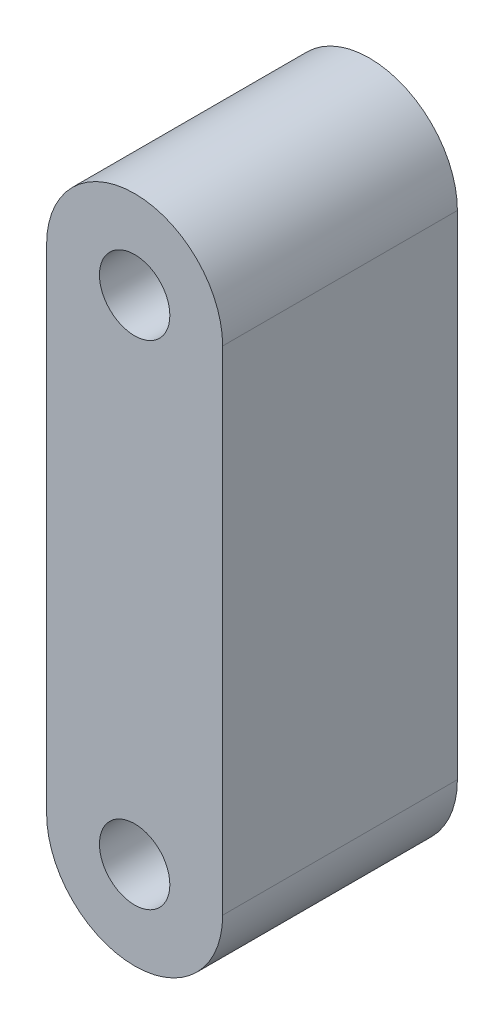
ISO-10303-21;
HEADER;
FILE_DESCRIPTION(('STEP AP214'),'2;1');
FILE_NAME('part.step','',(''),(''),'','','');
FILE_SCHEMA(('AUTOMOTIVE_DESIGN { 1 0 10303 214 1 1 1 1 }'));
ENDSEC;
DATA;
#1=APPLICATION_CONTEXT('core data for automotive mechanical design processes');
#2=APPLICATION_PROTOCOL_DEFINITION('international standard','automotive_design',2000,#1);
#3=PRODUCT_CONTEXT('',#1,'mechanical');
#4=PRODUCT('Part','Part','',(#3));
#5=PRODUCT_RELATED_PRODUCT_CATEGORY('part','',(#4));
#6=PRODUCT_DEFINITION_FORMATION('','',#4);
#7=PRODUCT_DEFINITION_CONTEXT('part definition',#1,'design');
#8=PRODUCT_DEFINITION('design','',#6,#7);
#9=PRODUCT_DEFINITION_SHAPE('','',#8);
#10=(LENGTH_UNIT() NAMED_UNIT(*) SI_UNIT(.MILLI.,.METRE.));
#11=(NAMED_UNIT(*) PLANE_ANGLE_UNIT() SI_UNIT($,.RADIAN.));
#12=(NAMED_UNIT(*) SI_UNIT($,.STERADIAN.) SOLID_ANGLE_UNIT());
#13=UNCERTAINTY_MEASURE_WITH_UNIT(LENGTH_MEASURE(1.E-05),#10,'distance_accuracy_value','');
#14=(GEOMETRIC_REPRESENTATION_CONTEXT(3) GLOBAL_UNCERTAINTY_ASSIGNED_CONTEXT((#13)) GLOBAL_UNIT_ASSIGNED_CONTEXT((#10,
#11,#12)) REPRESENTATION_CONTEXT('',''));
#15=CARTESIAN_POINT('',(0.,0.,0.));
#16=DIRECTION('',(0.,0.,1.));
#17=DIRECTION('',(1.,0.,0.));
#18=AXIS2_PLACEMENT_3D('',#15,#16,#17);
#19=CARTESIAN_POINT('',(0.,0.,10.));
#20=DIRECTION('',(0.,0.,1.));
#21=DIRECTION('',(1.,0.,0.));
#22=AXIS2_PLACEMENT_3D('',#19,#20,#21);
#23=PLANE('',#22);
#24=CARTESIAN_POINT('',(0.,21.,10.));
#25=DIRECTION('',(0.,0.,1.));
#26=DIRECTION('',(1.,0.,0.));
#27=AXIS2_PLACEMENT_3D('',#24,#25,#26);
#28=CIRCLE('',#27,1.5);
#29=CARTESIAN_POINT('',(1.5,21.,10.));
#30=VERTEX_POINT('',#29);
#31=EDGE_CURVE('E112',#30,#30,#28,.T.);
#32=ORIENTED_EDGE('',*,*,#31,.F.);
#33=EDGE_LOOP('',(#32));
#34=FACE_BOUND('',#33,.T.);
#35=CARTESIAN_POINT('',(0.,0.,10.));
#36=DIRECTION('',(0.,0.,1.));
#37=DIRECTION('',(1.,0.,0.));
#38=AXIS2_PLACEMENT_3D('',#35,#36,#37);
#39=CIRCLE('',#38,3.75);
#40=CARTESIAN_POINT('',(-3.75,0.,10.));
#41=VERTEX_POINT('',#40);
#42=CARTESIAN_POINT('',(3.75,0.,10.));
#43=VERTEX_POINT('',#42);
#44=EDGE_CURVE('E92',#41,#43,#39,.T.);
#45=ORIENTED_EDGE('',*,*,#44,.T.);
#46=DIRECTION('',(0.,1.,0.));
#47=VECTOR('',#46,1.);
#48=CARTESIAN_POINT('',(3.75,0.,10.));
#49=LINE('',#48,#47);
#50=CARTESIAN_POINT('',(3.75,21.,10.));
#51=VERTEX_POINT('',#50);
#52=EDGE_CURVE('E87',#43,#51,#49,.T.);
#53=ORIENTED_EDGE('',*,*,#52,.T.);
#54=CARTESIAN_POINT('',(0.,21.,10.));
#55=DIRECTION('',(0.,0.,1.));
#56=DIRECTION('',(1.,0.,0.));
#57=AXIS2_PLACEMENT_3D('',#54,#55,#56);
#58=CIRCLE('',#57,3.75);
#59=CARTESIAN_POINT('',(-3.75,21.,10.));
#60=VERTEX_POINT('',#59);
#61=EDGE_CURVE('E90',#51,#60,#58,.T.);
#62=ORIENTED_EDGE('',*,*,#61,.T.);
#63=DIRECTION('',(0.,-1.,0.));
#64=VECTOR('',#63,1.);
#65=CARTESIAN_POINT('',(-3.75,0.,10.));
#66=LINE('',#65,#64);
#67=EDGE_CURVE('E57',#60,#41,#66,.T.);
#68=ORIENTED_EDGE('',*,*,#67,.T.);
#69=EDGE_LOOP('',(#45,#53,#62,#68));
#70=FACE_BOUND('',#69,.T.);
#71=CARTESIAN_POINT('',(0.,0.,10.));
#72=DIRECTION('',(0.,0.,1.));
#73=DIRECTION('',(1.,0.,0.));
#74=AXIS2_PLACEMENT_3D('',#71,#72,#73);
#75=CIRCLE('',#74,1.5);
#76=CARTESIAN_POINT('',(1.5,0.,10.));
#77=VERTEX_POINT('',#76);
#78=EDGE_CURVE('E134',#77,#77,#75,.T.);
#79=ORIENTED_EDGE('',*,*,#78,.F.);
#80=EDGE_LOOP('',(#79));
#81=FACE_BOUND('',#80,.T.);
#82=ADVANCED_FACE('F39',(#34,#70,#81),#23,.T.);
#83=CARTESIAN_POINT('',(0.,0.,0.));
#84=DIRECTION('',(0.,0.,1.));
#85=DIRECTION('',(1.,0.,0.));
#86=AXIS2_PLACEMENT_3D('',#83,#84,#85);
#87=PLANE('',#86);
#88=CARTESIAN_POINT('',(0.,0.,0.));
#89=DIRECTION('',(0.,0.,1.));
#90=DIRECTION('',(1.,0.,0.));
#91=AXIS2_PLACEMENT_3D('',#88,#89,#90);
#92=CIRCLE('',#91,3.75);
#93=CARTESIAN_POINT('',(-3.75,0.,0.));
#94=VERTEX_POINT('',#93);
#95=CARTESIAN_POINT('',(3.75,0.,0.));
#96=VERTEX_POINT('',#95);
#97=EDGE_CURVE('E108',#94,#96,#92,.T.);
#98=ORIENTED_EDGE('',*,*,#97,.F.);
#99=DIRECTION('',(0.,-1.,0.));
#100=VECTOR('',#99,1.);
#101=CARTESIAN_POINT('',(-3.75,0.,0.));
#102=LINE('',#101,#100);
#103=CARTESIAN_POINT('',(-3.75,21.,0.));
#104=VERTEX_POINT('',#103);
#105=EDGE_CURVE('E80',#104,#94,#102,.T.);
#106=ORIENTED_EDGE('',*,*,#105,.F.);
#107=CARTESIAN_POINT('',(0.,21.,0.));
#108=DIRECTION('',(0.,0.,1.));
#109=DIRECTION('',(1.,0.,0.));
#110=AXIS2_PLACEMENT_3D('',#107,#108,#109);
#111=CIRCLE('',#110,3.75);
#112=CARTESIAN_POINT('',(3.75,21.,0.));
#113=VERTEX_POINT('',#112);
#114=EDGE_CURVE('E74',#113,#104,#111,.T.);
#115=ORIENTED_EDGE('',*,*,#114,.F.);
#116=DIRECTION('',(0.,1.,0.));
#117=VECTOR('',#116,1.);
#118=CARTESIAN_POINT('',(3.75,0.,0.));
#119=LINE('',#118,#117);
#120=EDGE_CURVE('E97',#96,#113,#119,.T.);
#121=ORIENTED_EDGE('',*,*,#120,.F.);
#122=EDGE_LOOP('',(#98,#106,#115,#121));
#123=FACE_BOUND('',#122,.T.);
#124=CARTESIAN_POINT('',(0.,21.,0.));
#125=DIRECTION('',(0.,0.,1.));
#126=DIRECTION('',(1.,0.,0.));
#127=AXIS2_PLACEMENT_3D('',#124,#125,#126);
#128=CIRCLE('',#127,1.5);
#129=CARTESIAN_POINT('',(1.5,21.,0.));
#130=VERTEX_POINT('',#129);
#131=EDGE_CURVE('E130',#130,#130,#128,.T.);
#132=ORIENTED_EDGE('',*,*,#131,.T.);
#133=EDGE_LOOP('',(#132));
#134=FACE_BOUND('',#133,.T.);
#135=CARTESIAN_POINT('',(0.,0.,0.));
#136=DIRECTION('',(0.,0.,1.));
#137=DIRECTION('',(1.,0.,0.));
#138=AXIS2_PLACEMENT_3D('',#135,#136,#137);
#139=CIRCLE('',#138,1.5);
#140=CARTESIAN_POINT('',(1.5,0.,0.));
#141=VERTEX_POINT('',#140);
#142=EDGE_CURVE('E138',#141,#141,#139,.T.);
#143=ORIENTED_EDGE('',*,*,#142,.T.);
#144=EDGE_LOOP('',(#143));
#145=FACE_BOUND('',#144,.T.);
#146=ADVANCED_FACE('F125',(#123,#134,#145),#87,.F.);
#147=CARTESIAN_POINT('',(0.,0.,10.));
#148=DIRECTION('',(0.,0.,-1.));
#149=DIRECTION('',(-1.,0.,0.));
#150=AXIS2_PLACEMENT_3D('',#147,#148,#149);
#151=CYLINDRICAL_SURFACE('',#150,3.75);
#152=ORIENTED_EDGE('',*,*,#97,.T.);
#153=DIRECTION('',(0.,0.,-1.));
#154=VECTOR('',#153,1.);
#155=CARTESIAN_POINT('',(3.75,0.,10.));
#156=LINE('',#155,#154);
#157=EDGE_CURVE('E11',#43,#96,#156,.T.);
#158=ORIENTED_EDGE('',*,*,#157,.F.);
#159=ORIENTED_EDGE('',*,*,#44,.F.);
#160=DIRECTION('',(0.,0.,-1.));
#161=VECTOR('',#160,1.);
#162=CARTESIAN_POINT('',(-3.75,0.,10.));
#163=LINE('',#162,#161);
#164=EDGE_CURVE('E104',#41,#94,#163,.T.);
#165=ORIENTED_EDGE('',*,*,#164,.T.);
#166=EDGE_LOOP('',(#152,#158,#159,#165));
#167=FACE_BOUND('',#166,.T.);
#168=ADVANCED_FACE('F41',(#167),#151,.T.);
#169=CARTESIAN_POINT('',(3.75,0.,10.));
#170=DIRECTION('',(-1.,0.,0.));
#171=DIRECTION('',(0.,0.,1.));
#172=AXIS2_PLACEMENT_3D('',#169,#170,#171);
#173=PLANE('',#172);
#174=ORIENTED_EDGE('',*,*,#120,.T.);
#175=DIRECTION('',(0.,0.,-1.));
#176=VECTOR('',#175,1.);
#177=CARTESIAN_POINT('',(3.75,21.,10.));
#178=LINE('',#177,#176);
#179=EDGE_CURVE('E49',#51,#113,#178,.T.);
#180=ORIENTED_EDGE('',*,*,#179,.F.);
#181=ORIENTED_EDGE('',*,*,#52,.F.);
#182=ORIENTED_EDGE('',*,*,#157,.T.);
#183=EDGE_LOOP('',(#174,#180,#181,#182));
#184=FACE_BOUND('',#183,.T.);
#185=ADVANCED_FACE('F96',(#184),#173,.F.);
#186=CARTESIAN_POINT('',(0.,21.,10.));
#187=DIRECTION('',(0.,0.,-1.));
#188=DIRECTION('',(-1.,0.,0.));
#189=AXIS2_PLACEMENT_3D('',#186,#187,#188);
#190=CYLINDRICAL_SURFACE('',#189,3.75);
#191=ORIENTED_EDGE('',*,*,#114,.T.);
#192=DIRECTION('',(0.,0.,-1.));
#193=VECTOR('',#192,1.);
#194=CARTESIAN_POINT('',(-3.75,21.,10.));
#195=LINE('',#194,#193);
#196=EDGE_CURVE('E99',#60,#104,#195,.T.);
#197=ORIENTED_EDGE('',*,*,#196,.F.);
#198=ORIENTED_EDGE('',*,*,#61,.F.);
#199=ORIENTED_EDGE('',*,*,#179,.T.);
#200=EDGE_LOOP('',(#191,#197,#198,#199));
#201=FACE_BOUND('',#200,.T.);
#202=ADVANCED_FACE('F100',(#201),#190,.T.);
#203=CARTESIAN_POINT('',(-3.75,0.,10.));
#204=DIRECTION('',(1.,0.,0.));
#205=DIRECTION('',(0.,0.,-1.));
#206=AXIS2_PLACEMENT_3D('',#203,#204,#205);
#207=PLANE('',#206);
#208=ORIENTED_EDGE('',*,*,#105,.T.);
#209=ORIENTED_EDGE('',*,*,#164,.F.);
#210=ORIENTED_EDGE('',*,*,#67,.F.);
#211=ORIENTED_EDGE('',*,*,#196,.T.);
#212=EDGE_LOOP('',(#208,#209,#210,#211));
#213=FACE_BOUND('',#212,.T.);
#214=ADVANCED_FACE('F122',(#213),#207,.F.);
#215=CARTESIAN_POINT('',(0.,21.,10.));
#216=DIRECTION('',(0.,0.,-1.));
#217=DIRECTION('',(-1.,0.,0.));
#218=AXIS2_PLACEMENT_3D('',#215,#216,#217);
#219=CYLINDRICAL_SURFACE('',#218,1.5);
#220=ORIENTED_EDGE('',*,*,#31,.T.);
#221=EDGE_LOOP('',(#220));
#222=FACE_BOUND('',#221,.T.);
#223=ORIENTED_EDGE('',*,*,#131,.F.);
#224=EDGE_LOOP('',(#223));
#225=FACE_BOUND('',#224,.T.);
#226=ADVANCED_FACE('F157',(#222,#225),#219,.F.);
#227=CARTESIAN_POINT('',(0.,0.,10.));
#228=DIRECTION('',(0.,0.,-1.));
#229=DIRECTION('',(-1.,0.,0.));
#230=AXIS2_PLACEMENT_3D('',#227,#228,#229);
#231=CYLINDRICAL_SURFACE('',#230,1.5);
#232=ORIENTED_EDGE('',*,*,#78,.T.);
#233=EDGE_LOOP('',(#232));
#234=FACE_BOUND('',#233,.T.);
#235=ORIENTED_EDGE('',*,*,#142,.F.);
#236=EDGE_LOOP('',(#235));
#237=FACE_BOUND('',#236,.T.);
#238=ADVANCED_FACE('F146',(#234,#237),#231,.F.);
#239=CLOSED_SHELL('',(#82,#146,#168,#185,#202,#214,#226,#238));
#240=MANIFOLD_SOLID_BREP('B2',#239);
#241=ADVANCED_BREP_SHAPE_REPRESENTATION('',(#18,#240),#14);
#242=SHAPE_DEFINITION_REPRESENTATION(#9,#241);
ENDSEC;
END-ISO-10303-21;
